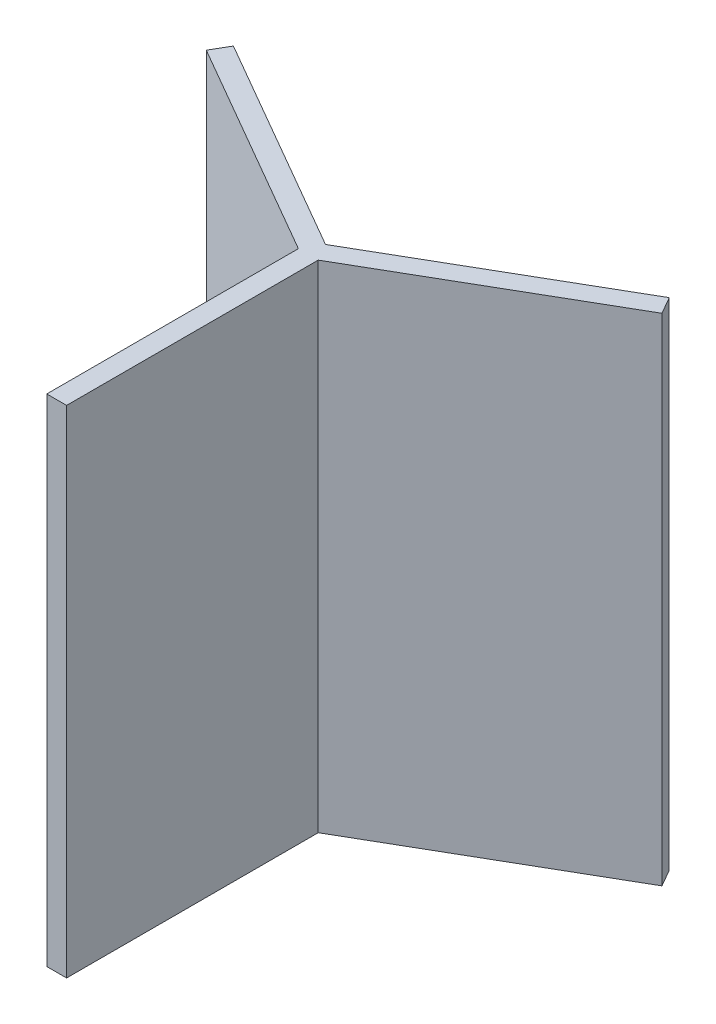
ISO-10303-21;
HEADER;
FILE_DESCRIPTION(('STEP AP214'),'2;1');
FILE_NAME('part.step','',(''),(''),'','','');
FILE_SCHEMA(('AUTOMOTIVE_DESIGN { 1 0 10303 214 1 1 1 1 }'));
ENDSEC;
DATA;
#1=APPLICATION_CONTEXT('core data for automotive mechanical design processes');
#2=APPLICATION_PROTOCOL_DEFINITION('international standard','automotive_design',2000,#1);
#3=PRODUCT_CONTEXT('',#1,'mechanical');
#4=PRODUCT('Part','Part','',(#3));
#5=PRODUCT_RELATED_PRODUCT_CATEGORY('part','',(#4));
#6=PRODUCT_DEFINITION_FORMATION('','',#4);
#7=PRODUCT_DEFINITION_CONTEXT('part definition',#1,'design');
#8=PRODUCT_DEFINITION('design','',#6,#7);
#9=PRODUCT_DEFINITION_SHAPE('','',#8);
#10=(LENGTH_UNIT() NAMED_UNIT(*) SI_UNIT(.MILLI.,.METRE.));
#11=(NAMED_UNIT(*) PLANE_ANGLE_UNIT() SI_UNIT($,.RADIAN.));
#12=(NAMED_UNIT(*) SI_UNIT($,.STERADIAN.) SOLID_ANGLE_UNIT());
#13=UNCERTAINTY_MEASURE_WITH_UNIT(LENGTH_MEASURE(1.E-05),#10,'distance_accuracy_value','');
#14=(GEOMETRIC_REPRESENTATION_CONTEXT(3) GLOBAL_UNCERTAINTY_ASSIGNED_CONTEXT((#13)) GLOBAL_UNIT_ASSIGNED_CONTEXT((#10,
#11,#12)) REPRESENTATION_CONTEXT('',''));
#15=CARTESIAN_POINT('',(0.,0.,0.));
#16=DIRECTION('',(0.,0.,1.));
#17=DIRECTION('',(1.,0.,0.));
#18=AXIS2_PLACEMENT_3D('',#15,#16,#17);
#19=CARTESIAN_POINT('',(49.9999999999992,5000.,86.6025403784444));
#20=DIRECTION('',(0.499999999999992,0.,0.866025403784443));
#21=DIRECTION('',(0.866025403784443,0.,-0.499999999999992));
#22=AXIS2_PLACEMENT_3D('',#19,#20,#21);
#23=PLANE('',#22);
#24=DIRECTION('',(-0.866025403784443,0.,0.499999999999992));
#25=VECTOR('',#24,1.);
#26=CARTESIAN_POINT('',(49.9999999999992,0.,86.6025403784444));
#27=LINE('',#26,#25);
#28=CARTESIAN_POINT('',(2297.23002686126,0.,-1210.83632056089));
#29=VERTEX_POINT('',#28);
#30=CARTESIAN_POINT('',(100.,0.,57.7350269189632));
#31=VERTEX_POINT('',#30);
#32=EDGE_CURVE('E135',#29,#31,#27,.T.);
#33=ORIENTED_EDGE('',*,*,#32,.F.);
#34=DIRECTION('',(0.,-1.,0.));
#35=VECTOR('',#34,1.);
#36=CARTESIAN_POINT('',(2297.23002686126,5000.,-1210.83632056089));
#37=LINE('',#36,#35);
#38=CARTESIAN_POINT('',(2297.23002686126,5000.,-1210.83632056089));
#39=VERTEX_POINT('',#38);
#40=EDGE_CURVE('E11',#39,#29,#37,.T.);
#41=ORIENTED_EDGE('',*,*,#40,.F.);
#42=DIRECTION('',(-0.866025403784443,0.,0.499999999999992));
#43=VECTOR('',#42,1.);
#44=CARTESIAN_POINT('',(49.9999999999992,5000.,86.6025403784444));
#45=LINE('',#44,#43);
#46=CARTESIAN_POINT('',(100.,5000.,57.7350269189632));
#47=VERTEX_POINT('',#46);
#48=EDGE_CURVE('E155',#39,#47,#45,.T.);
#49=ORIENTED_EDGE('',*,*,#48,.T.);
#50=DIRECTION('',(0.,-1.,0.));
#51=VECTOR('',#50,1.);
#52=CARTESIAN_POINT('',(100.,5000.,57.7350269189632));
#53=LINE('',#52,#51);
#54=EDGE_CURVE('E88',#47,#31,#53,.T.);
#55=ORIENTED_EDGE('',*,*,#54,.T.);
#56=EDGE_LOOP('',(#33,#41,#49,#55));
#57=FACE_BOUND('',#56,.T.);
#58=ADVANCED_FACE('F35',(#57),#23,.T.);
#59=CARTESIAN_POINT('',(2247.23002686126,5000.,-1297.43886093934));
#60=DIRECTION('',(-0.866025403784442,0.,0.499999999999994));
#61=DIRECTION('',(0.499999999999994,0.,0.866025403784442));
#62=AXIS2_PLACEMENT_3D('',#59,#60,#61);
#63=PLANE('',#62);
#64=DIRECTION('',(-0.499999999999994,0.,-0.866025403784442));
#65=VECTOR('',#64,1.);
#66=CARTESIAN_POINT('',(2247.23002686126,0.,-1297.43886093934));
#67=LINE('',#66,#65);
#68=CARTESIAN_POINT('',(2197.23002686127,0.,-1384.04140131778));
#69=VERTEX_POINT('',#68);
#70=EDGE_CURVE('E138',#29,#69,#67,.T.);
#71=ORIENTED_EDGE('',*,*,#70,.T.);
#72=DIRECTION('',(0.,-1.,0.));
#73=VECTOR('',#72,1.);
#74=CARTESIAN_POINT('',(2197.23002686127,5000.,-1384.04140131778));
#75=LINE('',#74,#73);
#76=CARTESIAN_POINT('',(2197.23002686127,5000.,-1384.04140131778));
#77=VERTEX_POINT('',#76);
#78=EDGE_CURVE('E43',#77,#69,#75,.T.);
#79=ORIENTED_EDGE('',*,*,#78,.F.);
#80=DIRECTION('',(-0.499999999999994,0.,-0.866025403784442));
#81=VECTOR('',#80,1.);
#82=CARTESIAN_POINT('',(2247.23002686126,5000.,-1297.43886093934));
#83=LINE('',#82,#81);
#84=EDGE_CURVE('E187',#39,#77,#83,.T.);
#85=ORIENTED_EDGE('',*,*,#84,.F.);
#86=ORIENTED_EDGE('',*,*,#40,.T.);
#87=EDGE_LOOP('',(#71,#79,#85,#86));
#88=FACE_BOUND('',#87,.T.);
#89=ADVANCED_FACE('F191',(#88),#63,.F.);
#90=CARTESIAN_POINT('',(-49.999999999999,5000.,-86.602540378444));
#91=DIRECTION('',(0.499999999999992,0.,0.866025403784443));
#92=DIRECTION('',(0.866025403784443,0.,-0.499999999999992));
#93=AXIS2_PLACEMENT_3D('',#90,#91,#92);
#94=PLANE('',#93);
#95=DIRECTION('',(-0.866025403784443,0.,0.499999999999992));
#96=VECTOR('',#95,1.);
#97=CARTESIAN_POINT('',(-49.999999999999,0.,-86.602540378444));
#98=LINE('',#97,#96);
#99=CARTESIAN_POINT('',(1.33226762955019E-12,0.,-115.470053837925));
#100=VERTEX_POINT('',#99);
#101=EDGE_CURVE('E140',#69,#100,#98,.T.);
#102=ORIENTED_EDGE('',*,*,#101,.T.);
#103=DIRECTION('',(0.,-1.,0.));
#104=VECTOR('',#103,1.);
#105=CARTESIAN_POINT('',(1.33226762955019E-12,5000.,-115.470053837925));
#106=LINE('',#105,#104);
#107=CARTESIAN_POINT('',(1.33226762955019E-12,5000.,-115.470053837925));
#108=VERTEX_POINT('',#107);
#109=EDGE_CURVE('E164',#108,#100,#106,.T.);
#110=ORIENTED_EDGE('',*,*,#109,.F.);
#111=DIRECTION('',(-0.866025403784443,0.,0.499999999999992));
#112=VECTOR('',#111,1.);
#113=CARTESIAN_POINT('',(-49.999999999999,5000.,-86.602540378444));
#114=LINE('',#113,#112);
#115=EDGE_CURVE('E172',#77,#108,#114,.T.);
#116=ORIENTED_EDGE('',*,*,#115,.F.);
#117=ORIENTED_EDGE('',*,*,#78,.T.);
#118=EDGE_LOOP('',(#102,#110,#116,#117));
#119=FACE_BOUND('',#118,.T.);
#120=ADVANCED_FACE('F170',(#119),#94,.F.);
#121=CARTESIAN_POINT('',(50.0000000000007,5000.,-86.6025403784441));
#122=DIRECTION('',(0.500000000000004,0.,-0.866025403784436));
#123=DIRECTION('',(-0.866025403784436,0.,-0.500000000000004));
#124=AXIS2_PLACEMENT_3D('',#121,#122,#123);
#125=PLANE('',#124);
#126=DIRECTION('',(0.866025403784436,0.,0.500000000000004));
#127=VECTOR('',#126,1.);
#128=CARTESIAN_POINT('',(50.0000000000007,0.,-86.6025403784441));
#129=LINE('',#128,#127);
#130=CARTESIAN_POINT('',(-2197.23002686125,0.,-1384.04140131781));
#131=VERTEX_POINT('',#130);
#132=EDGE_CURVE('E143',#131,#100,#129,.T.);
#133=ORIENTED_EDGE('',*,*,#132,.F.);
#134=DIRECTION('',(0.,-1.,0.));
#135=VECTOR('',#134,1.);
#136=CARTESIAN_POINT('',(-2197.23002686125,5000.,-1384.04140131781));
#137=LINE('',#136,#135);
#138=CARTESIAN_POINT('',(-2197.23002686125,5000.,-1384.04140131781));
#139=VERTEX_POINT('',#138);
#140=EDGE_CURVE('E162',#139,#131,#137,.T.);
#141=ORIENTED_EDGE('',*,*,#140,.F.);
#142=DIRECTION('',(0.866025403784436,0.,0.500000000000004));
#143=VECTOR('',#142,1.);
#144=CARTESIAN_POINT('',(50.0000000000007,5000.,-86.6025403784441));
#145=LINE('',#144,#143);
#146=EDGE_CURVE('E185',#139,#108,#145,.T.);
#147=ORIENTED_EDGE('',*,*,#146,.T.);
#148=ORIENTED_EDGE('',*,*,#109,.T.);
#149=EDGE_LOOP('',(#133,#141,#147,#148));
#150=FACE_BOUND('',#149,.T.);
#151=ADVANCED_FACE('F181',(#150),#125,.T.);
#152=CARTESIAN_POINT('',(-2247.23002686125,5000.,-1297.43886093936));
#153=DIRECTION('',(0.866025403784437,0.,0.500000000000003));
#154=DIRECTION('',(0.500000000000003,0.,-0.866025403784437));
#155=AXIS2_PLACEMENT_3D('',#152,#153,#154);
#156=PLANE('',#155);
#157=DIRECTION('',(-0.500000000000003,0.,0.866025403784437));
#158=VECTOR('',#157,1.);
#159=CARTESIAN_POINT('',(-2247.23002686125,0.,-1297.43886093936));
#160=LINE('',#159,#158);
#161=CARTESIAN_POINT('',(-2297.23002686125,0.,-1210.83632056092));
#162=VERTEX_POINT('',#161);
#163=EDGE_CURVE('E146',#131,#162,#160,.T.);
#164=ORIENTED_EDGE('',*,*,#163,.T.);
#165=DIRECTION('',(0.,-1.,0.));
#166=VECTOR('',#165,1.);
#167=CARTESIAN_POINT('',(-2297.23002686125,5000.,-1210.83632056092));
#168=LINE('',#167,#166);
#169=CARTESIAN_POINT('',(-2297.23002686125,5000.,-1210.83632056092));
#170=VERTEX_POINT('',#169);
#171=EDGE_CURVE('E159',#170,#162,#168,.T.);
#172=ORIENTED_EDGE('',*,*,#171,.F.);
#173=DIRECTION('',(-0.500000000000003,0.,0.866025403784437));
#174=VECTOR('',#173,1.);
#175=CARTESIAN_POINT('',(-2247.23002686125,5000.,-1297.43886093936));
#176=LINE('',#175,#174);
#177=EDGE_CURVE('E130',#139,#170,#176,.T.);
#178=ORIENTED_EDGE('',*,*,#177,.F.);
#179=ORIENTED_EDGE('',*,*,#140,.T.);
#180=EDGE_LOOP('',(#164,#172,#178,#179));
#181=FACE_BOUND('',#180,.T.);
#182=ADVANCED_FACE('F201',(#181),#156,.F.);
#183=CARTESIAN_POINT('',(-50.0000000000004,5000.,86.6025403784437));
#184=DIRECTION('',(0.500000000000004,0.,-0.866025403784436));
#185=DIRECTION('',(-0.866025403784436,0.,-0.500000000000004));
#186=AXIS2_PLACEMENT_3D('',#183,#184,#185);
#187=PLANE('',#186);
#188=DIRECTION('',(0.866025403784436,0.,0.500000000000004));
#189=VECTOR('',#188,1.);
#190=CARTESIAN_POINT('',(-50.0000000000004,0.,86.6025403784437));
#191=LINE('',#190,#189);
#192=CARTESIAN_POINT('',(-100.,0.,57.7350269189623));
#193=VERTEX_POINT('',#192);
#194=EDGE_CURVE('E148',#162,#193,#191,.T.);
#195=ORIENTED_EDGE('',*,*,#194,.T.);
#196=DIRECTION('',(0.,-1.,0.));
#197=VECTOR('',#196,1.);
#198=CARTESIAN_POINT('',(-100.,5000.,57.7350269189623));
#199=LINE('',#198,#197);
#200=CARTESIAN_POINT('',(-100.,5000.,57.7350269189623));
#201=VERTEX_POINT('',#200);
#202=EDGE_CURVE('E119',#201,#193,#199,.T.);
#203=ORIENTED_EDGE('',*,*,#202,.F.);
#204=DIRECTION('',(0.866025403784436,0.,0.500000000000004));
#205=VECTOR('',#204,1.);
#206=CARTESIAN_POINT('',(-50.0000000000004,5000.,86.6025403784437));
#207=LINE('',#206,#205);
#208=EDGE_CURVE('E127',#170,#201,#207,.T.);
#209=ORIENTED_EDGE('',*,*,#208,.F.);
#210=ORIENTED_EDGE('',*,*,#171,.T.);
#211=EDGE_LOOP('',(#195,#203,#209,#210));
#212=FACE_BOUND('',#211,.T.);
#213=ADVANCED_FACE('F204',(#212),#187,.F.);
#214=CARTESIAN_POINT('',(-100.,5000.,0.));
#215=DIRECTION('',(-1.,0.,0.));
#216=DIRECTION('',(0.,0.,1.));
#217=AXIS2_PLACEMENT_3D('',#214,#215,#216);
#218=PLANE('',#217);
#219=DIRECTION('',(0.,0.,-1.));
#220=VECTOR('',#219,1.);
#221=CARTESIAN_POINT('',(-100.,0.,0.));
#222=LINE('',#221,#220);
#223=CARTESIAN_POINT('',(-100.,0.,2594.87772187871));
#224=VERTEX_POINT('',#223);
#225=EDGE_CURVE('E118',#224,#193,#222,.T.);
#226=ORIENTED_EDGE('',*,*,#225,.F.);
#227=DIRECTION('',(0.,-1.,0.));
#228=VECTOR('',#227,1.);
#229=CARTESIAN_POINT('',(-100.,5000.,2594.87772187871));
#230=LINE('',#229,#228);
#231=CARTESIAN_POINT('',(-100.,5000.,2594.87772187871));
#232=VERTEX_POINT('',#231);
#233=EDGE_CURVE('E112',#232,#224,#230,.T.);
#234=ORIENTED_EDGE('',*,*,#233,.F.);
#235=DIRECTION('',(0.,0.,-1.));
#236=VECTOR('',#235,1.);
#237=CARTESIAN_POINT('',(-100.,5000.,0.));
#238=LINE('',#237,#236);
#239=EDGE_CURVE('E116',#232,#201,#238,.T.);
#240=ORIENTED_EDGE('',*,*,#239,.T.);
#241=ORIENTED_EDGE('',*,*,#202,.T.);
#242=EDGE_LOOP('',(#226,#234,#240,#241));
#243=FACE_BOUND('',#242,.T.);
#244=ADVANCED_FACE('F114',(#243),#218,.T.);
#245=CARTESIAN_POINT('',(0.,5000.,2594.87772187871));
#246=DIRECTION('',(0.,0.,-1.));
#247=DIRECTION('',(-1.,0.,0.));
#248=AXIS2_PLACEMENT_3D('',#245,#246,#247);
#249=PLANE('',#248);
#250=DIRECTION('',(1.,0.,0.));
#251=VECTOR('',#250,1.);
#252=CARTESIAN_POINT('',(0.,0.,2594.87772187871));
#253=LINE('',#252,#251);
#254=CARTESIAN_POINT('',(100.,0.,2594.87772187871));
#255=VERTEX_POINT('',#254);
#256=EDGE_CURVE('E81',#224,#255,#253,.T.);
#257=ORIENTED_EDGE('',*,*,#256,.T.);
#258=DIRECTION('',(0.,-1.,0.));
#259=VECTOR('',#258,1.);
#260=CARTESIAN_POINT('',(100.,5000.,2594.87772187871));
#261=LINE('',#260,#259);
#262=CARTESIAN_POINT('',(100.,5000.,2594.87772187871));
#263=VERTEX_POINT('',#262);
#264=EDGE_CURVE('E120',#263,#255,#261,.T.);
#265=ORIENTED_EDGE('',*,*,#264,.F.);
#266=DIRECTION('',(1.,0.,0.));
#267=VECTOR('',#266,1.);
#268=CARTESIAN_POINT('',(0.,5000.,2594.87772187871));
#269=LINE('',#268,#267);
#270=EDGE_CURVE('E122',#232,#263,#269,.T.);
#271=ORIENTED_EDGE('',*,*,#270,.F.);
#272=ORIENTED_EDGE('',*,*,#233,.T.);
#273=EDGE_LOOP('',(#257,#265,#271,#272));
#274=FACE_BOUND('',#273,.T.);
#275=ADVANCED_FACE('F123',(#274),#249,.F.);
#276=CARTESIAN_POINT('',(100.,5000.,0.));
#277=DIRECTION('',(-1.,0.,0.));
#278=DIRECTION('',(0.,0.,1.));
#279=AXIS2_PLACEMENT_3D('',#276,#277,#278);
#280=PLANE('',#279);
#281=DIRECTION('',(0.,0.,-1.));
#282=VECTOR('',#281,1.);
#283=CARTESIAN_POINT('',(100.,0.,0.));
#284=LINE('',#283,#282);
#285=EDGE_CURVE('E153',#255,#31,#284,.T.);
#286=ORIENTED_EDGE('',*,*,#285,.T.);
#287=ORIENTED_EDGE('',*,*,#54,.F.);
#288=DIRECTION('',(0.,0.,-1.));
#289=VECTOR('',#288,1.);
#290=CARTESIAN_POINT('',(100.,5000.,0.));
#291=LINE('',#290,#289);
#292=EDGE_CURVE('E51',#263,#47,#291,.T.);
#293=ORIENTED_EDGE('',*,*,#292,.F.);
#294=ORIENTED_EDGE('',*,*,#264,.T.);
#295=EDGE_LOOP('',(#286,#287,#293,#294));
#296=FACE_BOUND('',#295,.T.);
#297=ADVANCED_FACE('F213',(#296),#280,.F.);
#298=CARTESIAN_POINT('',(0.,5000.,0.));
#299=DIRECTION('',(0.,1.,0.));
#300=DIRECTION('',(0.,0.,1.));
#301=AXIS2_PLACEMENT_3D('',#298,#299,#300);
#302=PLANE('',#301);
#303=ORIENTED_EDGE('',*,*,#48,.F.);
#304=ORIENTED_EDGE('',*,*,#84,.T.);
#305=ORIENTED_EDGE('',*,*,#115,.T.);
#306=ORIENTED_EDGE('',*,*,#146,.F.);
#307=ORIENTED_EDGE('',*,*,#177,.T.);
#308=ORIENTED_EDGE('',*,*,#208,.T.);
#309=ORIENTED_EDGE('',*,*,#239,.F.);
#310=ORIENTED_EDGE('',*,*,#270,.T.);
#311=ORIENTED_EDGE('',*,*,#292,.T.);
#312=EDGE_LOOP('',(#303,#304,#305,#306,#307,#308,#309,#310,#311));
#313=FACE_BOUND('',#312,.T.);
#314=ADVANCED_FACE('F125',(#313),#302,.T.);
#315=CARTESIAN_POINT('',(0.,0.,0.));
#316=DIRECTION('',(0.,1.,0.));
#317=DIRECTION('',(0.,0.,1.));
#318=AXIS2_PLACEMENT_3D('',#315,#316,#317);
#319=PLANE('',#318);
#320=ORIENTED_EDGE('',*,*,#32,.T.);
#321=ORIENTED_EDGE('',*,*,#285,.F.);
#322=ORIENTED_EDGE('',*,*,#256,.F.);
#323=ORIENTED_EDGE('',*,*,#225,.T.);
#324=ORIENTED_EDGE('',*,*,#194,.F.);
#325=ORIENTED_EDGE('',*,*,#163,.F.);
#326=ORIENTED_EDGE('',*,*,#132,.T.);
#327=ORIENTED_EDGE('',*,*,#101,.F.);
#328=ORIENTED_EDGE('',*,*,#70,.F.);
#329=EDGE_LOOP('',(#320,#321,#322,#323,#324,#325,#326,#327,#328));
#330=FACE_BOUND('',#329,.T.);
#331=ADVANCED_FACE('F176',(#330),#319,.F.);
#332=CLOSED_SHELL('',(#58,#89,#120,#151,#182,#213,#244,#275,#297,#314,#331));
#333=MANIFOLD_SOLID_BREP('B2',#332);
#334=ADVANCED_BREP_SHAPE_REPRESENTATION('',(#18,#333),#14);
#335=SHAPE_DEFINITION_REPRESENTATION(#9,#334);
ENDSEC;
END-ISO-10303-21;
